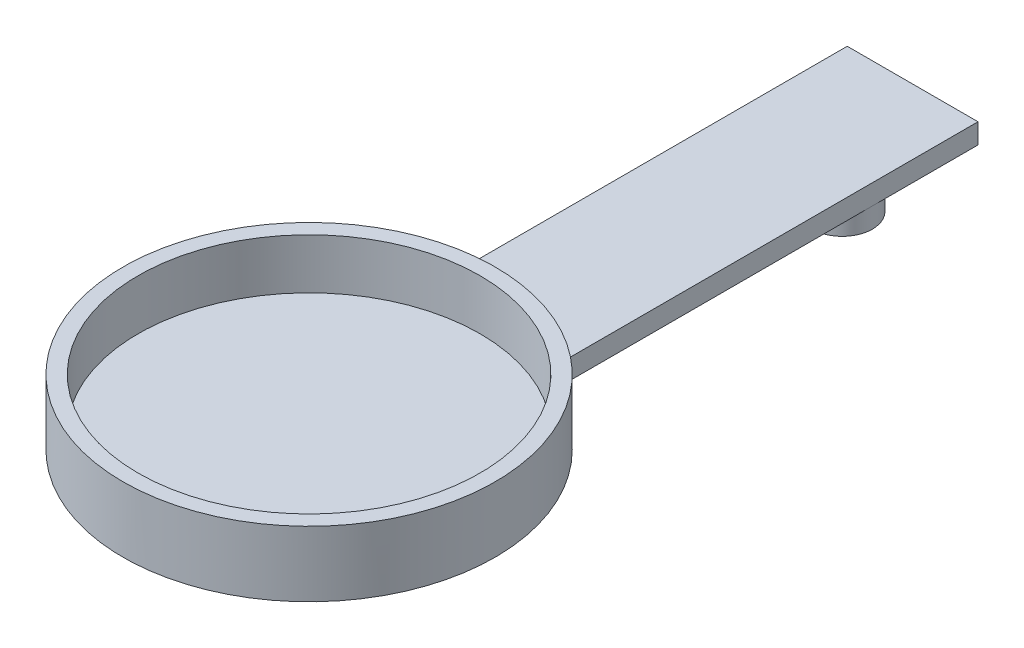
ISO-10303-21;
HEADER;
FILE_DESCRIPTION(('STEP AP214'),'2;1');
FILE_NAME('part.step','',(''),(''),'','','');
FILE_SCHEMA(('AUTOMOTIVE_DESIGN { 1 0 10303 214 1 1 1 1 }'));
ENDSEC;
DATA;
#1=APPLICATION_CONTEXT('core data for automotive mechanical design processes');
#2=APPLICATION_PROTOCOL_DEFINITION('international standard','automotive_design',2000,#1);
#3=PRODUCT_CONTEXT('',#1,'mechanical');
#4=PRODUCT('Part','Part','',(#3));
#5=PRODUCT_RELATED_PRODUCT_CATEGORY('part','',(#4));
#6=PRODUCT_DEFINITION_FORMATION('','',#4);
#7=PRODUCT_DEFINITION_CONTEXT('part definition',#1,'design');
#8=PRODUCT_DEFINITION('design','',#6,#7);
#9=PRODUCT_DEFINITION_SHAPE('','',#8);
#10=(LENGTH_UNIT() NAMED_UNIT(*) SI_UNIT(.MILLI.,.METRE.));
#11=(NAMED_UNIT(*) PLANE_ANGLE_UNIT() SI_UNIT($,.RADIAN.));
#12=(NAMED_UNIT(*) SI_UNIT($,.STERADIAN.) SOLID_ANGLE_UNIT());
#13=UNCERTAINTY_MEASURE_WITH_UNIT(LENGTH_MEASURE(1.E-05),#10,'distance_accuracy_value','');
#14=(GEOMETRIC_REPRESENTATION_CONTEXT(3) GLOBAL_UNCERTAINTY_ASSIGNED_CONTEXT((#13)) GLOBAL_UNIT_ASSIGNED_CONTEXT((#10,
#11,#12)) REPRESENTATION_CONTEXT('',''));
#15=CARTESIAN_POINT('',(0.,0.,0.));
#16=DIRECTION('',(0.,0.,1.));
#17=DIRECTION('',(1.,0.,0.));
#18=AXIS2_PLACEMENT_3D('',#15,#16,#17);
#19=CARTESIAN_POINT('',(0.,-0.5,0.));
#20=DIRECTION('',(0.,1.,0.));
#21=DIRECTION('',(0.,0.,1.));
#22=AXIS2_PLACEMENT_3D('',#19,#20,#21);
#23=PLANE('',#22);
#24=DIRECTION('',(-1.,0.,0.));
#25=VECTOR('',#24,1.);
#26=CARTESIAN_POINT('',(-6.5,-0.5,11.1087241161396));
#27=LINE('',#26,#25);
#28=CARTESIAN_POINT('',(6.5,-0.5,11.1087241161396));
#29=VERTEX_POINT('',#28);
#30=CARTESIAN_POINT('',(5.73606797749979,-0.5,11.1087241161396));
#31=VERTEX_POINT('',#30);
#32=EDGE_CURVE('E225',#29,#31,#27,.T.);
#33=ORIENTED_EDGE('',*,*,#32,.T.);
#34=CARTESIAN_POINT('',(3.5,-0.5,9.10872411613958));
#35=DIRECTION('',(0.,1.,0.));
#36=DIRECTION('',(0.,0.,1.));
#37=AXIS2_PLACEMENT_3D('',#34,#35,#36);
#38=CIRCLE('',#37,3.);
#39=CARTESIAN_POINT('',(6.5,-0.5,9.10872411613958));
#40=VERTEX_POINT('',#39);
#41=EDGE_CURVE('E192',#31,#40,#38,.T.);
#42=ORIENTED_EDGE('',*,*,#41,.T.);
#43=DIRECTION('',(0.,0.,1.));
#44=VECTOR('',#43,1.);
#45=CARTESIAN_POINT('',(6.5,-0.5,-60.));
#46=LINE('',#45,#44);
#47=EDGE_CURVE('E219',#40,#29,#46,.T.);
#48=ORIENTED_EDGE('',*,*,#47,.T.);
#49=EDGE_LOOP('',(#33,#42,#48));
#50=FACE_BOUND('',#49,.T.);
#51=ADVANCED_FACE('F35',(#50),#23,.F.);
#52=CARTESIAN_POINT('',(-6.5,1.5,11.1087241161396));
#53=DIRECTION('',(0.,0.,1.));
#54=DIRECTION('',(1.,0.,0.));
#55=AXIS2_PLACEMENT_3D('',#52,#53,#54);
#56=PLANE('',#55);
#57=DIRECTION('',(0.,-1.,0.));
#58=VECTOR('',#57,1.);
#59=CARTESIAN_POINT('',(1.26393202250021,0.,11.1087241161396));
#60=LINE('',#59,#58);
#61=CARTESIAN_POINT('',(1.26393202250021,0.,11.1087241161396));
#62=VERTEX_POINT('',#61);
#63=CARTESIAN_POINT('',(1.26393202250021,-0.5,11.1087241161396));
#64=VERTEX_POINT('',#63);
#65=EDGE_CURVE('E58',#62,#64,#60,.T.);
#66=ORIENTED_EDGE('',*,*,#65,.F.);
#67=DIRECTION('',(1.,0.,0.));
#68=VECTOR('',#67,1.);
#69=CARTESIAN_POINT('',(0.,0.,11.1087241161396));
#70=LINE('',#69,#68);
#71=CARTESIAN_POINT('',(-1.26393202250021,0.,11.1087241161396));
#72=VERTEX_POINT('',#71);
#73=EDGE_CURVE('E273',#72,#62,#70,.T.);
#74=ORIENTED_EDGE('',*,*,#73,.F.);
#75=DIRECTION('',(0.,-1.,0.));
#76=VECTOR('',#75,1.);
#77=CARTESIAN_POINT('',(-1.26393202250021,0.,11.1087241161396));
#78=LINE('',#77,#76);
#79=CARTESIAN_POINT('',(-1.26393202250021,-0.5,11.1087241161396));
#80=VERTEX_POINT('',#79);
#81=EDGE_CURVE('E208',#80,#72,#78,.F.);
#82=ORIENTED_EDGE('',*,*,#81,.F.);
#83=EDGE_CURVE('E229',#64,#80,#27,.T.);
#84=ORIENTED_EDGE('',*,*,#83,.F.);
#85=EDGE_LOOP('',(#66,#74,#82,#84));
#86=FACE_BOUND('',#85,.T.);
#87=ADVANCED_FACE('F295',(#86),#56,.T.);
#88=DIRECTION('',(0.,-1.,0.));
#89=VECTOR('',#88,1.);
#90=CARTESIAN_POINT('',(-5.73606797749979,0.,11.1087241161396));
#91=LINE('',#90,#89);
#92=CARTESIAN_POINT('',(-5.73606797749979,0.,11.1087241161396));
#93=VERTEX_POINT('',#92);
#94=CARTESIAN_POINT('',(-5.73606797749979,-0.5,11.1087241161396));
#95=VERTEX_POINT('',#94);
#96=EDGE_CURVE('E210',#93,#95,#91,.T.);
#97=ORIENTED_EDGE('',*,*,#96,.F.);
#98=CARTESIAN_POINT('',(-6.5,0.,11.1087241161396));
#99=VERTEX_POINT('',#98);
#100=EDGE_CURVE('E269',#99,#93,#70,.T.);
#101=ORIENTED_EDGE('',*,*,#100,.F.);
#102=DIRECTION('',(0.,-1.,0.));
#103=VECTOR('',#102,1.);
#104=CARTESIAN_POINT('',(-6.5,1.5,11.1087241161396));
#105=LINE('',#104,#103);
#106=CARTESIAN_POINT('',(-6.5,-0.5,11.1087241161396));
#107=VERTEX_POINT('',#106);
#108=EDGE_CURVE('E238',#99,#107,#105,.T.);
#109=ORIENTED_EDGE('',*,*,#108,.T.);
#110=EDGE_CURVE('E223',#95,#107,#27,.T.);
#111=ORIENTED_EDGE('',*,*,#110,.F.);
#112=EDGE_LOOP('',(#97,#101,#109,#111));
#113=FACE_BOUND('',#112,.T.);
#114=ADVANCED_FACE('F286',(#113),#56,.T.);
#115=CARTESIAN_POINT('',(6.5,-0.5,-49.5));
#116=VERTEX_POINT('',#115);
#117=EDGE_CURVE('E224',#116,#40,#46,.T.);
#118=ORIENTED_EDGE('',*,*,#117,.T.);
#119=EDGE_CURVE('E190',#40,#64,#38,.T.);
#120=ORIENTED_EDGE('',*,*,#119,.T.);
#121=ORIENTED_EDGE('',*,*,#83,.T.);
#122=CARTESIAN_POINT('',(-3.5,-0.5,9.10872411613958));
#123=DIRECTION('',(0.,1.,0.));
#124=DIRECTION('',(0.,0.,1.));
#125=AXIS2_PLACEMENT_3D('',#122,#123,#124);
#126=CIRCLE('',#125,3.);
#127=CARTESIAN_POINT('',(-6.5,-0.5,9.10872411613958));
#128=VERTEX_POINT('',#127);
#129=EDGE_CURVE('E11',#80,#128,#126,.T.);
#130=ORIENTED_EDGE('',*,*,#129,.T.);
#131=DIRECTION('',(0.,0.,-1.));
#132=VECTOR('',#131,1.);
#133=CARTESIAN_POINT('',(-6.5,-0.5,-60.));
#134=LINE('',#133,#132);
#135=CARTESIAN_POINT('',(-6.5,-0.5,-60.));
#136=VERTEX_POINT('',#135);
#137=EDGE_CURVE('E212',#128,#136,#134,.T.);
#138=ORIENTED_EDGE('',*,*,#137,.T.);
#139=DIRECTION('',(1.,0.,0.));
#140=VECTOR('',#139,1.);
#141=CARTESIAN_POINT('',(-6.5,-0.5,-60.));
#142=LINE('',#141,#140);
#143=CARTESIAN_POINT('',(6.5,-0.5,-60.));
#144=VERTEX_POINT('',#143);
#145=EDGE_CURVE('E216',#136,#144,#142,.T.);
#146=ORIENTED_EDGE('',*,*,#145,.T.);
#147=EDGE_CURVE('E220',#144,#116,#46,.T.);
#148=ORIENTED_EDGE('',*,*,#147,.T.);
#149=CARTESIAN_POINT('',(3.5,-0.5,-49.5));
#150=DIRECTION('',(0.,1.,0.));
#151=DIRECTION('',(0.,0.,1.));
#152=AXIS2_PLACEMENT_3D('',#149,#150,#151);
#153=CIRCLE('',#152,3.);
#154=CARTESIAN_POINT('',(3.5,-0.5,-52.5));
#155=VERTEX_POINT('',#154);
#156=EDGE_CURVE('E201',#116,#155,#153,.T.);
#157=ORIENTED_EDGE('',*,*,#156,.T.);
#158=DIRECTION('',(0.,0.,1.));
#159=VECTOR('',#158,1.);
#160=CARTESIAN_POINT('',(3.5,-0.5,-51.5));
#161=LINE('',#160,#159);
#162=CARTESIAN_POINT('',(3.5,-0.5,-51.5));
#163=VERTEX_POINT('',#162);
#164=EDGE_CURVE('E154',#155,#163,#161,.T.);
#165=ORIENTED_EDGE('',*,*,#164,.T.);
#166=CARTESIAN_POINT('',(3.5,-0.5,-49.5));
#167=DIRECTION('',(0.,1.,0.));
#168=DIRECTION('',(0.,0.,1.));
#169=AXIS2_PLACEMENT_3D('',#166,#167,#168);
#170=CIRCLE('',#169,2.);
#171=CARTESIAN_POINT('',(3.5,-0.5,-47.5));
#172=VERTEX_POINT('',#171);
#173=EDGE_CURVE('E149',#163,#172,#170,.T.);
#174=ORIENTED_EDGE('',*,*,#173,.T.);
#175=DIRECTION('',(0.,0.,1.));
#176=VECTOR('',#175,1.);
#177=CARTESIAN_POINT('',(3.5,-0.5,-46.5));
#178=LINE('',#177,#176);
#179=CARTESIAN_POINT('',(3.5,-0.5,-46.5));
#180=VERTEX_POINT('',#179);
#181=EDGE_CURVE('E157',#172,#180,#178,.T.);
#182=ORIENTED_EDGE('',*,*,#181,.T.);
#183=EDGE_CURVE('E200',#180,#116,#153,.T.);
#184=ORIENTED_EDGE('',*,*,#183,.T.);
#185=EDGE_LOOP('',(#118,#120,#121,#130,#138,#146,#148,#157,#165,#174,#182,#184));
#186=FACE_BOUND('',#185,.T.);
#187=ADVANCED_FACE('F164',(#186),#23,.F.);
#188=CARTESIAN_POINT('',(0.,1.5,0.));
#189=DIRECTION('',(0.,-1.,0.));
#190=DIRECTION('',(0.,0.,-1.));
#191=AXIS2_PLACEMENT_3D('',#188,#189,#190);
#192=CYLINDRICAL_SURFACE('',#191,18.5);
#193=CARTESIAN_POINT('',(0.,1.5,0.));
#194=DIRECTION('',(0.,1.,0.));
#195=DIRECTION('',(0.,0.,1.));
#196=AXIS2_PLACEMENT_3D('',#193,#194,#195);
#197=CIRCLE('',#196,18.5);
#198=CARTESIAN_POINT('',(6.5,1.5,-17.3205080756888));
#199=VERTEX_POINT('',#198);
#200=CARTESIAN_POINT('',(-6.5,1.5,-17.3205080756888));
#201=VERTEX_POINT('',#200);
#202=EDGE_CURVE('E274',#199,#201,#197,.T.);
#203=ORIENTED_EDGE('',*,*,#202,.T.);
#204=DIRECTION('',(0.,-1.,0.));
#205=VECTOR('',#204,1.);
#206=CARTESIAN_POINT('',(-6.5,1.5,-17.3205080756888));
#207=LINE('',#206,#205);
#208=CARTESIAN_POINT('',(-6.5,0.,-17.3205080756888));
#209=VERTEX_POINT('',#208);
#210=EDGE_CURVE('E251',#201,#209,#207,.T.);
#211=ORIENTED_EDGE('',*,*,#210,.T.);
#212=CARTESIAN_POINT('',(0.,0.,0.));
#213=DIRECTION('',(0.,1.,0.));
#214=DIRECTION('',(0.,0.,1.));
#215=AXIS2_PLACEMENT_3D('',#212,#213,#214);
#216=CIRCLE('',#215,18.5);
#217=CARTESIAN_POINT('',(6.5,0.,-17.3205080756888));
#218=VERTEX_POINT('',#217);
#219=EDGE_CURVE('E260',#209,#218,#216,.T.);
#220=ORIENTED_EDGE('',*,*,#219,.T.);
#221=DIRECTION('',(0.,-1.,0.));
#222=VECTOR('',#221,1.);
#223=CARTESIAN_POINT('',(6.5,1.5,-17.3205080756888));
#224=LINE('',#223,#222);
#225=EDGE_CURVE('E241',#218,#199,#224,.F.);
#226=ORIENTED_EDGE('',*,*,#225,.T.);
#227=EDGE_LOOP('',(#203,#211,#220,#226));
#228=FACE_BOUND('',#227,.T.);
#229=CARTESIAN_POINT('',(0.,6.5,0.));
#230=DIRECTION('',(0.,1.,0.));
#231=DIRECTION('',(0.,0.,1.));
#232=AXIS2_PLACEMENT_3D('',#229,#230,#231);
#233=CIRCLE('',#232,18.5);
#234=CARTESIAN_POINT('',(0.,6.5,18.5));
#235=VERTEX_POINT('',#234);
#236=EDGE_CURVE('E257',#235,#235,#233,.T.);
#237=ORIENTED_EDGE('',*,*,#236,.F.);
#238=EDGE_LOOP('',(#237));
#239=FACE_BOUND('',#238,.T.);
#240=ADVANCED_FACE('F37',(#228,#239),#192,.T.);
#241=CARTESIAN_POINT('',(0.,0.,0.));
#242=DIRECTION('',(0.,1.,0.));
#243=DIRECTION('',(0.,0.,1.));
#244=AXIS2_PLACEMENT_3D('',#241,#242,#243);
#245=PLANE('',#244);
#246=ORIENTED_EDGE('',*,*,#73,.T.);
#247=CARTESIAN_POINT('',(3.5,0.,9.10872411613958));
#248=DIRECTION('',(0.,-1.,0.));
#249=DIRECTION('',(0.,0.,-1.));
#250=AXIS2_PLACEMENT_3D('',#247,#248,#249);
#251=CIRCLE('',#250,3.);
#252=CARTESIAN_POINT('',(5.73606797749979,0.,11.1087241161396));
#253=VERTEX_POINT('',#252);
#254=EDGE_CURVE('E187',#253,#62,#251,.T.);
#255=ORIENTED_EDGE('',*,*,#254,.F.);
#256=CARTESIAN_POINT('',(6.5,0.,11.1087241161396));
#257=VERTEX_POINT('',#256);
#258=EDGE_CURVE('E268',#253,#257,#70,.T.);
#259=ORIENTED_EDGE('',*,*,#258,.T.);
#260=DIRECTION('',(0.,0.,-1.));
#261=VECTOR('',#260,1.);
#262=CARTESIAN_POINT('',(6.5,0.,0.));
#263=LINE('',#262,#261);
#264=EDGE_CURVE('E266',#257,#218,#263,.T.);
#265=ORIENTED_EDGE('',*,*,#264,.T.);
#266=ORIENTED_EDGE('',*,*,#219,.F.);
#267=DIRECTION('',(0.,0.,1.));
#268=VECTOR('',#267,1.);
#269=CARTESIAN_POINT('',(-6.5,0.,0.));
#270=LINE('',#269,#268);
#271=EDGE_CURVE('E272',#209,#99,#270,.T.);
#272=ORIENTED_EDGE('',*,*,#271,.T.);
#273=ORIENTED_EDGE('',*,*,#100,.T.);
#274=CARTESIAN_POINT('',(-3.5,0.,9.10872411613958));
#275=DIRECTION('',(0.,-1.,0.));
#276=DIRECTION('',(0.,0.,-1.));
#277=AXIS2_PLACEMENT_3D('',#274,#275,#276);
#278=CIRCLE('',#277,3.);
#279=EDGE_CURVE('E206',#72,#93,#278,.T.);
#280=ORIENTED_EDGE('',*,*,#279,.F.);
#281=EDGE_LOOP('',(#246,#255,#259,#265,#266,#272,#273,#280));
#282=FACE_BOUND('',#281,.T.);
#283=ADVANCED_FACE('F299',(#282),#245,.F.);
#284=CARTESIAN_POINT('',(0.,6.5,0.));
#285=DIRECTION('',(0.,1.,0.));
#286=DIRECTION('',(0.,0.,1.));
#287=AXIS2_PLACEMENT_3D('',#284,#285,#286);
#288=PLANE('',#287);
#289=ORIENTED_EDGE('',*,*,#236,.T.);
#290=EDGE_LOOP('',(#289));
#291=FACE_BOUND('',#290,.T.);
#292=CARTESIAN_POINT('',(0.,6.5,0.));
#293=DIRECTION('',(0.,1.,0.));
#294=DIRECTION('',(0.,0.,1.));
#295=AXIS2_PLACEMENT_3D('',#292,#293,#294);
#296=CIRCLE('',#295,17.);
#297=CARTESIAN_POINT('',(0.,6.5,17.));
#298=VERTEX_POINT('',#297);
#299=EDGE_CURVE('E254',#298,#298,#296,.T.);
#300=ORIENTED_EDGE('',*,*,#299,.F.);
#301=EDGE_LOOP('',(#300));
#302=FACE_BOUND('',#301,.T.);
#303=ADVANCED_FACE('F360',(#291,#302),#288,.T.);
#304=CARTESIAN_POINT('',(0.,6.5,0.));
#305=DIRECTION('',(0.,-1.,0.));
#306=DIRECTION('',(0.,0.,-1.));
#307=AXIS2_PLACEMENT_3D('',#304,#305,#306);
#308=CYLINDRICAL_SURFACE('',#307,17.);
#309=ORIENTED_EDGE('',*,*,#299,.T.);
#310=EDGE_LOOP('',(#309));
#311=FACE_BOUND('',#310,.T.);
#312=CARTESIAN_POINT('',(0.,1.5,0.));
#313=DIRECTION('',(0.,1.,0.));
#314=DIRECTION('',(0.,0.,1.));
#315=AXIS2_PLACEMENT_3D('',#312,#313,#314);
#316=CIRCLE('',#315,17.);
#317=CARTESIAN_POINT('',(0.,1.5,17.));
#318=VERTEX_POINT('',#317);
#319=EDGE_CURVE('E263',#318,#318,#316,.F.);
#320=ORIENTED_EDGE('',*,*,#319,.T.);
#321=EDGE_LOOP('',(#320));
#322=FACE_BOUND('',#321,.T.);
#323=ADVANCED_FACE('F356',(#311,#322),#308,.F.);
#324=CARTESIAN_POINT('',(0.,1.5,0.));
#325=DIRECTION('',(0.,1.,0.));
#326=DIRECTION('',(0.,0.,1.));
#327=AXIS2_PLACEMENT_3D('',#324,#325,#326);
#328=PLANE('',#327);
#329=ORIENTED_EDGE('',*,*,#319,.F.);
#330=EDGE_LOOP('',(#329));
#331=FACE_BOUND('',#330,.T.);
#332=ADVANCED_FACE('F359',(#331),#328,.T.);
#333=CARTESIAN_POINT('',(0.,1.5,0.));
#334=DIRECTION('',(0.,1.,0.));
#335=DIRECTION('',(0.,0.,1.));
#336=AXIS2_PLACEMENT_3D('',#333,#334,#335);
#337=PLANE('',#336);
#338=ORIENTED_EDGE('',*,*,#202,.F.);
#339=DIRECTION('',(0.,0.,1.));
#340=VECTOR('',#339,1.);
#341=CARTESIAN_POINT('',(6.5,1.5,-60.));
#342=LINE('',#341,#340);
#343=CARTESIAN_POINT('',(6.5,1.5,-60.));
#344=VERTEX_POINT('',#343);
#345=EDGE_CURVE('E234',#344,#199,#342,.T.);
#346=ORIENTED_EDGE('',*,*,#345,.F.);
#347=DIRECTION('',(1.,0.,0.));
#348=VECTOR('',#347,1.);
#349=CARTESIAN_POINT('',(-6.5,1.5,-60.));
#350=LINE('',#349,#348);
#351=CARTESIAN_POINT('',(-6.5,1.5,-60.));
#352=VERTEX_POINT('',#351);
#353=EDGE_CURVE('E231',#352,#344,#350,.T.);
#354=ORIENTED_EDGE('',*,*,#353,.F.);
#355=DIRECTION('',(0.,0.,-1.));
#356=VECTOR('',#355,1.);
#357=CARTESIAN_POINT('',(-6.5,1.5,-60.));
#358=LINE('',#357,#356);
#359=EDGE_CURVE('E228',#201,#352,#358,.T.);
#360=ORIENTED_EDGE('',*,*,#359,.F.);
#361=EDGE_LOOP('',(#338,#346,#354,#360));
#362=FACE_BOUND('',#361,.T.);
#363=ADVANCED_FACE('F354',(#362),#337,.T.);
#364=CARTESIAN_POINT('',(-6.5,1.5,-60.));
#365=DIRECTION('',(-1.,0.,0.));
#366=DIRECTION('',(0.,0.,1.));
#367=AXIS2_PLACEMENT_3D('',#364,#365,#366);
#368=PLANE('',#367);
#369=ORIENTED_EDGE('',*,*,#137,.F.);
#370=EDGE_CURVE('E213',#107,#128,#134,.T.);
#371=ORIENTED_EDGE('',*,*,#370,.F.);
#372=ORIENTED_EDGE('',*,*,#108,.F.);
#373=ORIENTED_EDGE('',*,*,#271,.F.);
#374=ORIENTED_EDGE('',*,*,#210,.F.);
#375=ORIENTED_EDGE('',*,*,#359,.T.);
#376=DIRECTION('',(0.,-1.,0.));
#377=VECTOR('',#376,1.);
#378=CARTESIAN_POINT('',(-6.5,1.5,-60.));
#379=LINE('',#378,#377);
#380=EDGE_CURVE('E237',#352,#136,#379,.T.);
#381=ORIENTED_EDGE('',*,*,#380,.T.);
#382=EDGE_LOOP('',(#369,#371,#372,#373,#374,#375,#381));
#383=FACE_BOUND('',#382,.T.);
#384=ADVANCED_FACE('F351',(#383),#368,.T.);
#385=DIRECTION('',(0.,-1.,0.));
#386=VECTOR('',#385,1.);
#387=CARTESIAN_POINT('',(5.73606797749979,0.,11.1087241161396));
#388=LINE('',#387,#386);
#389=EDGE_CURVE('E194',#31,#253,#388,.F.);
#390=ORIENTED_EDGE('',*,*,#389,.F.);
#391=ORIENTED_EDGE('',*,*,#32,.F.);
#392=DIRECTION('',(0.,-1.,0.));
#393=VECTOR('',#392,1.);
#394=CARTESIAN_POINT('',(6.5,1.5,11.1087241161396));
#395=LINE('',#394,#393);
#396=EDGE_CURVE('E242',#257,#29,#395,.T.);
#397=ORIENTED_EDGE('',*,*,#396,.F.);
#398=ORIENTED_EDGE('',*,*,#258,.F.);
#399=EDGE_LOOP('',(#390,#391,#397,#398));
#400=FACE_BOUND('',#399,.T.);
#401=ADVANCED_FACE('F308',(#400),#56,.T.);
#402=CARTESIAN_POINT('',(6.5,1.5,-60.));
#403=DIRECTION('',(1.,0.,0.));
#404=DIRECTION('',(0.,0.,-1.));
#405=AXIS2_PLACEMENT_3D('',#402,#403,#404);
#406=PLANE('',#405);
#407=ORIENTED_EDGE('',*,*,#47,.F.);
#408=ORIENTED_EDGE('',*,*,#117,.F.);
#409=ORIENTED_EDGE('',*,*,#147,.F.);
#410=DIRECTION('',(0.,-1.,0.));
#411=VECTOR('',#410,1.);
#412=CARTESIAN_POINT('',(6.5,1.5,-60.));
#413=LINE('',#412,#411);
#414=EDGE_CURVE('E245',#344,#144,#413,.T.);
#415=ORIENTED_EDGE('',*,*,#414,.F.);
#416=ORIENTED_EDGE('',*,*,#345,.T.);
#417=ORIENTED_EDGE('',*,*,#225,.F.);
#418=ORIENTED_EDGE('',*,*,#264,.F.);
#419=ORIENTED_EDGE('',*,*,#396,.T.);
#420=EDGE_LOOP('',(#407,#408,#409,#415,#416,#417,#418,#419));
#421=FACE_BOUND('',#420,.T.);
#422=ADVANCED_FACE('F306',(#421),#406,.T.);
#423=CARTESIAN_POINT('',(-6.5,1.5,-60.));
#424=DIRECTION('',(0.,0.,-1.));
#425=DIRECTION('',(-1.,0.,0.));
#426=AXIS2_PLACEMENT_3D('',#423,#424,#425);
#427=PLANE('',#426);
#428=ORIENTED_EDGE('',*,*,#414,.T.);
#429=ORIENTED_EDGE('',*,*,#145,.F.);
#430=ORIENTED_EDGE('',*,*,#380,.F.);
#431=ORIENTED_EDGE('',*,*,#353,.T.);
#432=EDGE_LOOP('',(#428,#429,#430,#431));
#433=FACE_BOUND('',#432,.T.);
#434=ADVANCED_FACE('F338',(#433),#427,.T.);
#435=ORIENTED_EDGE('',*,*,#370,.T.);
#436=EDGE_CURVE('E39',#128,#95,#126,.T.);
#437=ORIENTED_EDGE('',*,*,#436,.T.);
#438=ORIENTED_EDGE('',*,*,#110,.T.);
#439=EDGE_LOOP('',(#435,#437,#438));
#440=FACE_BOUND('',#439,.T.);
#441=ADVANCED_FACE('F280',(#440),#23,.F.);
#442=CARTESIAN_POINT('',(-3.5,0.,9.10872411613958));
#443=DIRECTION('',(0.,-1.,0.));
#444=DIRECTION('',(0.,0.,-1.));
#445=AXIS2_PLACEMENT_3D('',#442,#443,#444);
#446=CYLINDRICAL_SURFACE('',#445,3.);
#447=ORIENTED_EDGE('',*,*,#279,.T.);
#448=ORIENTED_EDGE('',*,*,#96,.T.);
#449=ORIENTED_EDGE('',*,*,#436,.F.);
#450=ORIENTED_EDGE('',*,*,#129,.F.);
#451=ORIENTED_EDGE('',*,*,#81,.T.);
#452=EDGE_LOOP('',(#447,#448,#449,#450,#451));
#453=FACE_BOUND('',#452,.T.);
#454=CARTESIAN_POINT('',(-3.5,-2.5,9.10872411613958));
#455=DIRECTION('',(0.,-1.,0.));
#456=DIRECTION('',(0.,0.,-1.));
#457=AXIS2_PLACEMENT_3D('',#454,#455,#456);
#458=CIRCLE('',#457,3.);
#459=CARTESIAN_POINT('',(-3.5,-2.5,6.10872411613958));
#460=VERTEX_POINT('',#459);
#461=EDGE_CURVE('E203',#460,#460,#458,.T.);
#462=ORIENTED_EDGE('',*,*,#461,.F.);
#463=EDGE_LOOP('',(#462));
#464=FACE_BOUND('',#463,.T.);
#465=ADVANCED_FACE('F292',(#453,#464),#446,.T.);
#466=CARTESIAN_POINT('',(-3.5,-2.5,9.10872411613958));
#467=DIRECTION('',(0.,-1.,0.));
#468=DIRECTION('',(0.,0.,-1.));
#469=AXIS2_PLACEMENT_3D('',#466,#467,#468);
#470=PLANE('',#469);
#471=CARTESIAN_POINT('',(-3.5,-2.5,9.10872411613958));
#472=DIRECTION('',(0.,-1.,0.));
#473=DIRECTION('',(0.,0.,-1.));
#474=AXIS2_PLACEMENT_3D('',#471,#472,#473);
#475=CIRCLE('',#474,1.4);
#476=CARTESIAN_POINT('',(-3.5,-2.5,7.70872411613958));
#477=VERTEX_POINT('',#476);
#478=EDGE_CURVE('E560',#477,#477,#475,.T.);
#479=ORIENTED_EDGE('',*,*,#478,.F.);
#480=EDGE_LOOP('',(#479));
#481=FACE_BOUND('',#480,.T.);
#482=ORIENTED_EDGE('',*,*,#461,.T.);
#483=EDGE_LOOP('',(#482));
#484=FACE_BOUND('',#483,.T.);
#485=ADVANCED_FACE('F343',(#481,#484),#470,.T.);
#486=CARTESIAN_POINT('',(3.5,0.,-49.5));
#487=DIRECTION('',(0.,-1.,0.));
#488=DIRECTION('',(0.,0.,-1.));
#489=AXIS2_PLACEMENT_3D('',#486,#487,#488);
#490=CYLINDRICAL_SURFACE('',#489,3.);
#491=DIRECTION('',(0.,-1.,0.));
#492=VECTOR('',#491,1.);
#493=CARTESIAN_POINT('',(3.5,-0.5,-52.5));
#494=LINE('',#493,#492);
#495=CARTESIAN_POINT('',(3.5,-2.5,-52.5));
#496=VERTEX_POINT('',#495);
#497=EDGE_CURVE('E182',#155,#496,#494,.T.);
#498=ORIENTED_EDGE('',*,*,#497,.F.);
#499=ORIENTED_EDGE('',*,*,#156,.F.);
#500=ORIENTED_EDGE('',*,*,#183,.F.);
#501=DIRECTION('',(0.,-1.,0.));
#502=VECTOR('',#501,1.);
#503=CARTESIAN_POINT('',(3.5,-0.5,-46.5));
#504=LINE('',#503,#502);
#505=CARTESIAN_POINT('',(3.5,-2.5,-46.5));
#506=VERTEX_POINT('',#505);
#507=EDGE_CURVE('E153',#180,#506,#504,.T.);
#508=ORIENTED_EDGE('',*,*,#507,.T.);
#509=CARTESIAN_POINT('',(3.5,-2.5,-49.5));
#510=DIRECTION('',(0.,-1.,0.));
#511=DIRECTION('',(0.,0.,-1.));
#512=AXIS2_PLACEMENT_3D('',#509,#510,#511);
#513=CIRCLE('',#512,3.);
#514=EDGE_CURVE('E197',#496,#506,#513,.T.);
#515=ORIENTED_EDGE('',*,*,#514,.F.);
#516=EDGE_LOOP('',(#498,#499,#500,#508,#515));
#517=FACE_BOUND('',#516,.T.);
#518=ADVANCED_FACE('F324',(#517),#490,.T.);
#519=CARTESIAN_POINT('',(3.5,-2.5,-49.5));
#520=DIRECTION('',(0.,-1.,0.));
#521=DIRECTION('',(0.,0.,-1.));
#522=AXIS2_PLACEMENT_3D('',#519,#520,#521);
#523=PLANE('',#522);
#524=CARTESIAN_POINT('',(3.5,-2.5,-49.5));
#525=DIRECTION('',(0.,-1.,0.));
#526=DIRECTION('',(0.,0.,-1.));
#527=AXIS2_PLACEMENT_3D('',#524,#525,#526);
#528=CIRCLE('',#527,1.4);
#529=CARTESIAN_POINT('',(3.5,-2.5,-50.9));
#530=VERTEX_POINT('',#529);
#531=EDGE_CURVE('E172',#530,#530,#528,.T.);
#532=ORIENTED_EDGE('',*,*,#531,.F.);
#533=EDGE_LOOP('',(#532));
#534=FACE_BOUND('',#533,.T.);
#535=DIRECTION('',(0.,0.,1.));
#536=VECTOR('',#535,1.);
#537=CARTESIAN_POINT('',(3.5,-2.5,-51.5));
#538=LINE('',#537,#536);
#539=CARTESIAN_POINT('',(3.5,-2.5,-51.5));
#540=VERTEX_POINT('',#539);
#541=EDGE_CURVE('E166',#496,#540,#538,.T.);
#542=ORIENTED_EDGE('',*,*,#541,.F.);
#543=ORIENTED_EDGE('',*,*,#514,.T.);
#544=DIRECTION('',(0.,0.,1.));
#545=VECTOR('',#544,1.);
#546=CARTESIAN_POINT('',(3.5,-2.5,-46.5));
#547=LINE('',#546,#545);
#548=CARTESIAN_POINT('',(3.5,-2.5,-47.5));
#549=VERTEX_POINT('',#548);
#550=EDGE_CURVE('E169',#549,#506,#547,.T.);
#551=ORIENTED_EDGE('',*,*,#550,.F.);
#552=CARTESIAN_POINT('',(3.5,-2.5,-49.5));
#553=DIRECTION('',(0.,1.,0.));
#554=DIRECTION('',(0.,0.,1.));
#555=AXIS2_PLACEMENT_3D('',#552,#553,#554);
#556=CIRCLE('',#555,2.);
#557=EDGE_CURVE('E50',#540,#549,#556,.T.);
#558=ORIENTED_EDGE('',*,*,#557,.F.);
#559=EDGE_LOOP('',(#542,#543,#551,#558));
#560=FACE_BOUND('',#559,.T.);
#561=ADVANCED_FACE('F315',(#534,#560),#523,.T.);
#562=CARTESIAN_POINT('',(3.5,0.,9.10872411613958));
#563=DIRECTION('',(0.,-1.,0.));
#564=DIRECTION('',(0.,0.,-1.));
#565=AXIS2_PLACEMENT_3D('',#562,#563,#564);
#566=CYLINDRICAL_SURFACE('',#565,3.);
#567=CARTESIAN_POINT('',(3.5,-2.5,9.10872411613958));
#568=DIRECTION('',(0.,-1.,0.));
#569=DIRECTION('',(0.,0.,-1.));
#570=AXIS2_PLACEMENT_3D('',#567,#568,#569);
#571=CIRCLE('',#570,3.);
#572=CARTESIAN_POINT('',(3.5,-2.5,6.10872411613958));
#573=VERTEX_POINT('',#572);
#574=EDGE_CURVE('E181',#573,#573,#571,.T.);
#575=ORIENTED_EDGE('',*,*,#574,.F.);
#576=EDGE_LOOP('',(#575));
#577=FACE_BOUND('',#576,.T.);
#578=ORIENTED_EDGE('',*,*,#41,.F.);
#579=ORIENTED_EDGE('',*,*,#389,.T.);
#580=ORIENTED_EDGE('',*,*,#254,.T.);
#581=ORIENTED_EDGE('',*,*,#65,.T.);
#582=ORIENTED_EDGE('',*,*,#119,.F.);
#583=EDGE_LOOP('',(#578,#579,#580,#581,#582));
#584=FACE_BOUND('',#583,.T.);
#585=ADVANCED_FACE('F312',(#577,#584),#566,.T.);
#586=CARTESIAN_POINT('',(3.5,-2.5,9.10872411613958));
#587=DIRECTION('',(0.,-1.,0.));
#588=DIRECTION('',(0.,0.,-1.));
#589=AXIS2_PLACEMENT_3D('',#586,#587,#588);
#590=PLANE('',#589);
#591=ORIENTED_EDGE('',*,*,#574,.T.);
#592=EDGE_LOOP('',(#591));
#593=FACE_BOUND('',#592,.T.);
#594=ADVANCED_FACE('F314',(#593),#590,.T.);
#595=CARTESIAN_POINT('',(3.5,-0.5,-49.5));
#596=DIRECTION('',(0.,-1.,0.));
#597=DIRECTION('',(0.,0.,-1.));
#598=AXIS2_PLACEMENT_3D('',#595,#596,#597);
#599=CYLINDRICAL_SURFACE('',#598,2.);
#600=ORIENTED_EDGE('',*,*,#557,.T.);
#601=DIRECTION('',(0.,-1.,0.));
#602=VECTOR('',#601,1.);
#603=CARTESIAN_POINT('',(3.5,-0.5,-47.5));
#604=LINE('',#603,#602);
#605=EDGE_CURVE('E145',#172,#549,#604,.T.);
#606=ORIENTED_EDGE('',*,*,#605,.F.);
#607=ORIENTED_EDGE('',*,*,#173,.F.);
#608=DIRECTION('',(0.,-1.,0.));
#609=VECTOR('',#608,1.);
#610=CARTESIAN_POINT('',(3.5,-0.5,-51.5));
#611=LINE('',#610,#609);
#612=EDGE_CURVE('E179',#163,#540,#611,.T.);
#613=ORIENTED_EDGE('',*,*,#612,.T.);
#614=EDGE_LOOP('',(#600,#606,#607,#613));
#615=FACE_BOUND('',#614,.T.);
#616=ADVANCED_FACE('F147',(#615),#599,.T.);
#617=CARTESIAN_POINT('',(3.5,-0.5,-51.5));
#618=DIRECTION('',(1.,0.,0.));
#619=DIRECTION('',(0.,0.,-1.));
#620=AXIS2_PLACEMENT_3D('',#617,#618,#619);
#621=PLANE('',#620);
#622=ORIENTED_EDGE('',*,*,#541,.T.);
#623=ORIENTED_EDGE('',*,*,#612,.F.);
#624=ORIENTED_EDGE('',*,*,#164,.F.);
#625=ORIENTED_EDGE('',*,*,#497,.T.);
#626=EDGE_LOOP('',(#622,#623,#624,#625));
#627=FACE_BOUND('',#626,.T.);
#628=ADVANCED_FACE('F487',(#627),#621,.F.);
#629=CARTESIAN_POINT('',(3.5,-0.5,-46.5));
#630=DIRECTION('',(1.,0.,0.));
#631=DIRECTION('',(0.,0.,-1.));
#632=AXIS2_PLACEMENT_3D('',#629,#630,#631);
#633=PLANE('',#632);
#634=ORIENTED_EDGE('',*,*,#550,.T.);
#635=ORIENTED_EDGE('',*,*,#507,.F.);
#636=ORIENTED_EDGE('',*,*,#181,.F.);
#637=ORIENTED_EDGE('',*,*,#605,.T.);
#638=EDGE_LOOP('',(#634,#635,#636,#637));
#639=FACE_BOUND('',#638,.T.);
#640=ADVANCED_FACE('F158',(#639),#633,.F.);
#641=CARTESIAN_POINT('',(3.5,0.5,-49.5));
#642=DIRECTION('',(0.,-1.,0.));
#643=DIRECTION('',(0.,0.,-1.));
#644=AXIS2_PLACEMENT_3D('',#641,#642,#643);
#645=CYLINDRICAL_SURFACE('',#644,1.4);
#646=CARTESIAN_POINT('',(3.5,0.5,-49.5));
#647=DIRECTION('',(0.,-1.,0.));
#648=DIRECTION('',(0.,0.,-1.));
#649=AXIS2_PLACEMENT_3D('',#646,#647,#648);
#650=CIRCLE('',#649,1.4);
#651=CARTESIAN_POINT('',(3.5,0.5,-50.9));
#652=VERTEX_POINT('',#651);
#653=EDGE_CURVE('E177',#652,#652,#650,.T.);
#654=ORIENTED_EDGE('',*,*,#653,.F.);
#655=EDGE_LOOP('',(#654));
#656=FACE_BOUND('',#655,.T.);
#657=ORIENTED_EDGE('',*,*,#531,.T.);
#658=EDGE_LOOP('',(#657));
#659=FACE_BOUND('',#658,.T.);
#660=ADVANCED_FACE('F501',(#656,#659),#645,.F.);
#661=CARTESIAN_POINT('',(3.5,0.5,-49.5));
#662=DIRECTION('',(0.,-1.,0.));
#663=DIRECTION('',(0.,0.,-1.));
#664=AXIS2_PLACEMENT_3D('',#661,#662,#663);
#665=PLANE('',#664);
#666=ORIENTED_EDGE('',*,*,#653,.T.);
#667=EDGE_LOOP('',(#666));
#668=FACE_BOUND('',#667,.T.);
#669=ADVANCED_FACE('F509',(#668),#665,.T.);
#670=CARTESIAN_POINT('',(-3.5,0.5,9.10872411613958));
#671=DIRECTION('',(0.,-1.,0.));
#672=DIRECTION('',(0.,0.,-1.));
#673=AXIS2_PLACEMENT_3D('',#670,#671,#672);
#674=CYLINDRICAL_SURFACE('',#673,1.4);
#675=CARTESIAN_POINT('',(-3.5,0.5,9.10872411613958));
#676=DIRECTION('',(0.,-1.,0.));
#677=DIRECTION('',(0.,0.,-1.));
#678=AXIS2_PLACEMENT_3D('',#675,#676,#677);
#679=CIRCLE('',#678,1.4);
#680=CARTESIAN_POINT('',(-3.5,0.5,7.70872411613958));
#681=VERTEX_POINT('',#680);
#682=EDGE_CURVE('E559',#681,#681,#679,.T.);
#683=ORIENTED_EDGE('',*,*,#682,.F.);
#684=EDGE_LOOP('',(#683));
#685=FACE_BOUND('',#684,.T.);
#686=ORIENTED_EDGE('',*,*,#478,.T.);
#687=EDGE_LOOP('',(#686));
#688=FACE_BOUND('',#687,.T.);
#689=ADVANCED_FACE('F518',(#685,#688),#674,.F.);
#690=CARTESIAN_POINT('',(-3.5,0.5,9.10872411613958));
#691=DIRECTION('',(0.,-1.,0.));
#692=DIRECTION('',(0.,0.,-1.));
#693=AXIS2_PLACEMENT_3D('',#690,#691,#692);
#694=PLANE('',#693);
#695=ORIENTED_EDGE('',*,*,#682,.T.);
#696=EDGE_LOOP('',(#695));
#697=FACE_BOUND('',#696,.T.);
#698=ADVANCED_FACE('F526',(#697),#694,.T.);
#699=CLOSED_SHELL('',(#51,#87,#114,#187,#240,#283,#303,#323,#332,#363,#384,#401,#422,#434,#441,
#465,#485,#518,#561,#585,#594,#616,#628,#640,#660,#669,#689,#698));
#700=MANIFOLD_SOLID_BREP('B2',#699);
#701=ADVANCED_BREP_SHAPE_REPRESENTATION('',(#18,#700),#14);
#702=SHAPE_DEFINITION_REPRESENTATION(#9,#701);
ENDSEC;
END-ISO-10303-21;
